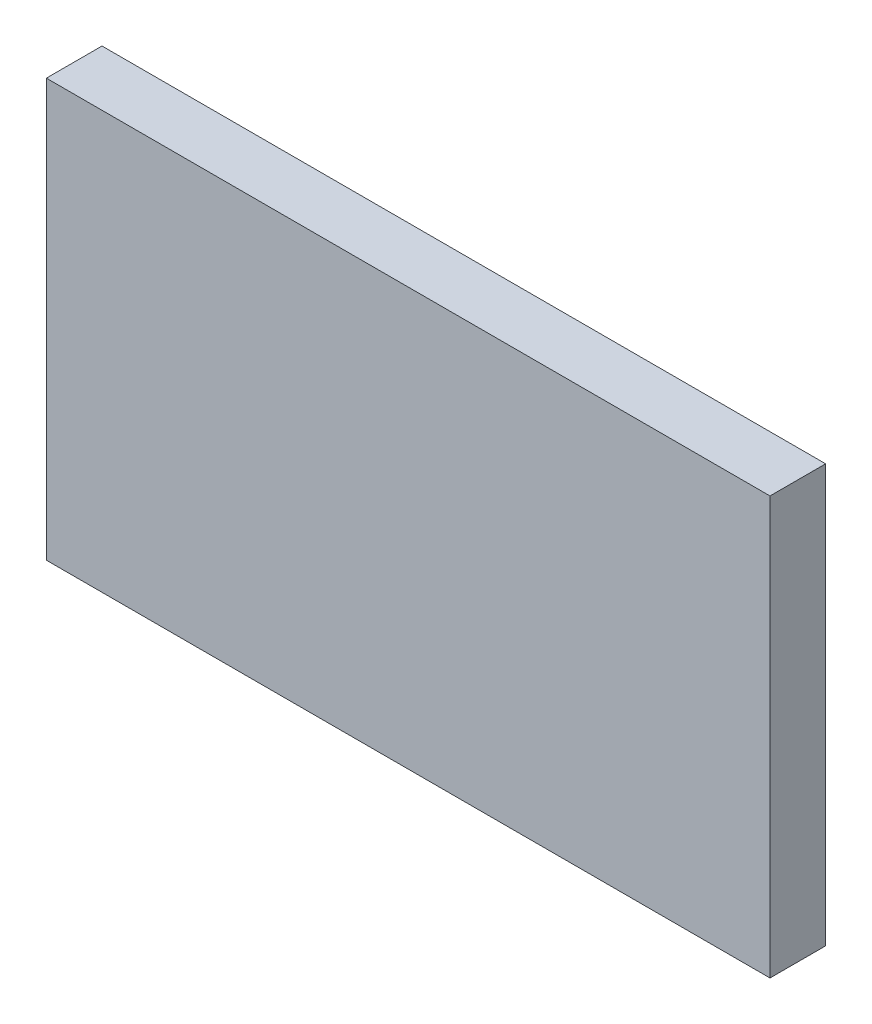
ISO-10303-21;
HEADER;
FILE_DESCRIPTION(('STEP AP214'),'2;1');
FILE_NAME('part.step','',(''),(''),'','','');
FILE_SCHEMA(('AUTOMOTIVE_DESIGN { 1 0 10303 214 1 1 1 1 }'));
ENDSEC;
DATA;
#1=APPLICATION_CONTEXT('core data for automotive mechanical design processes');
#2=APPLICATION_PROTOCOL_DEFINITION('international standard','automotive_design',2000,#1);
#3=PRODUCT_CONTEXT('',#1,'mechanical');
#4=PRODUCT('Part','Part','',(#3));
#5=PRODUCT_RELATED_PRODUCT_CATEGORY('part','',(#4));
#6=PRODUCT_DEFINITION_FORMATION('','',#4);
#7=PRODUCT_DEFINITION_CONTEXT('part definition',#1,'design');
#8=PRODUCT_DEFINITION('design','',#6,#7);
#9=PRODUCT_DEFINITION_SHAPE('','',#8);
#10=(LENGTH_UNIT() NAMED_UNIT(*) SI_UNIT(.MILLI.,.METRE.));
#11=(NAMED_UNIT(*) PLANE_ANGLE_UNIT() SI_UNIT($,.RADIAN.));
#12=(NAMED_UNIT(*) SI_UNIT($,.STERADIAN.) SOLID_ANGLE_UNIT());
#13=UNCERTAINTY_MEASURE_WITH_UNIT(LENGTH_MEASURE(1.E-05),#10,'distance_accuracy_value','');
#14=(GEOMETRIC_REPRESENTATION_CONTEXT(3) GLOBAL_UNCERTAINTY_ASSIGNED_CONTEXT((#13)) GLOBAL_UNIT_ASSIGNED_CONTEXT((#10,
#11,#12)) REPRESENTATION_CONTEXT('',''));
#15=CARTESIAN_POINT('',(0.,0.,0.));
#16=DIRECTION('',(0.,0.,1.));
#17=DIRECTION('',(1.,0.,0.));
#18=AXIS2_PLACEMENT_3D('',#15,#16,#17);
#19=CARTESIAN_POINT('',(0.,75.,0.));
#20=DIRECTION('',(-1.,0.,0.));
#21=DIRECTION('',(0.,0.,1.));
#22=AXIS2_PLACEMENT_3D('',#19,#20,#21);
#23=PLANE('',#22);
#24=DIRECTION('',(0.,0.,-1.));
#25=VECTOR('',#24,1.);
#26=CARTESIAN_POINT('',(0.,0.,0.));
#27=LINE('',#26,#25);
#28=CARTESIAN_POINT('',(0.,0.,0.));
#29=VERTEX_POINT('',#28);
#30=CARTESIAN_POINT('',(0.,0.,-10.));
#31=VERTEX_POINT('',#30);
#32=EDGE_CURVE('E96',#29,#31,#27,.T.);
#33=ORIENTED_EDGE('',*,*,#32,.T.);
#34=DIRECTION('',(0.,-1.,0.));
#35=VECTOR('',#34,1.);
#36=CARTESIAN_POINT('',(0.,75.,-10.));
#37=LINE('',#36,#35);
#38=CARTESIAN_POINT('',(0.,75.,-10.));
#39=VERTEX_POINT('',#38);
#40=EDGE_CURVE('E11',#39,#31,#37,.T.);
#41=ORIENTED_EDGE('',*,*,#40,.F.);
#42=DIRECTION('',(0.,0.,-1.));
#43=VECTOR('',#42,1.);
#44=CARTESIAN_POINT('',(0.,75.,0.));
#45=LINE('',#44,#43);
#46=CARTESIAN_POINT('',(0.,75.,0.));
#47=VERTEX_POINT('',#46);
#48=EDGE_CURVE('E84',#47,#39,#45,.T.);
#49=ORIENTED_EDGE('',*,*,#48,.F.);
#50=DIRECTION('',(0.,-1.,0.));
#51=VECTOR('',#50,1.);
#52=CARTESIAN_POINT('',(0.,75.,0.));
#53=LINE('',#52,#51);
#54=EDGE_CURVE('E92',#47,#29,#53,.T.);
#55=ORIENTED_EDGE('',*,*,#54,.T.);
#56=EDGE_LOOP('',(#33,#41,#49,#55));
#57=FACE_BOUND('',#56,.T.);
#58=ADVANCED_FACE('F33',(#57),#23,.F.);
#59=CARTESIAN_POINT('',(0.,75.,-10.));
#60=DIRECTION('',(0.,0.,1.));
#61=DIRECTION('',(1.,0.,0.));
#62=AXIS2_PLACEMENT_3D('',#59,#60,#61);
#63=PLANE('',#62);
#64=DIRECTION('',(-1.,0.,0.));
#65=VECTOR('',#64,1.);
#66=CARTESIAN_POINT('',(0.,0.,-10.));
#67=LINE('',#66,#65);
#68=CARTESIAN_POINT('',(-130.,0.,-9.99999999999999));
#69=VERTEX_POINT('',#68);
#70=EDGE_CURVE('E88',#31,#69,#67,.T.);
#71=ORIENTED_EDGE('',*,*,#70,.T.);
#72=DIRECTION('',(0.,-1.,0.));
#73=VECTOR('',#72,1.);
#74=CARTESIAN_POINT('',(-130.,75.,-9.99999999999999));
#75=LINE('',#74,#73);
#76=CARTESIAN_POINT('',(-130.,75.,-9.99999999999999));
#77=VERTEX_POINT('',#76);
#78=EDGE_CURVE('E41',#77,#69,#75,.T.);
#79=ORIENTED_EDGE('',*,*,#78,.F.);
#80=DIRECTION('',(-1.,0.,0.));
#81=VECTOR('',#80,1.);
#82=CARTESIAN_POINT('',(0.,75.,-10.));
#83=LINE('',#82,#81);
#84=EDGE_CURVE('E79',#39,#77,#83,.T.);
#85=ORIENTED_EDGE('',*,*,#84,.F.);
#86=ORIENTED_EDGE('',*,*,#40,.T.);
#87=EDGE_LOOP('',(#71,#79,#85,#86));
#88=FACE_BOUND('',#87,.T.);
#89=ADVANCED_FACE('F87',(#88),#63,.F.);
#90=CARTESIAN_POINT('',(-130.,75.,0.));
#91=DIRECTION('',(1.,0.,0.));
#92=DIRECTION('',(0.,0.,-1.));
#93=AXIS2_PLACEMENT_3D('',#90,#91,#92);
#94=PLANE('',#93);
#95=DIRECTION('',(0.,0.,1.));
#96=VECTOR('',#95,1.);
#97=CARTESIAN_POINT('',(-130.,0.,0.));
#98=LINE('',#97,#96);
#99=CARTESIAN_POINT('',(-130.,0.,0.));
#100=VERTEX_POINT('',#99);
#101=EDGE_CURVE('E66',#69,#100,#98,.T.);
#102=ORIENTED_EDGE('',*,*,#101,.T.);
#103=DIRECTION('',(0.,-1.,0.));
#104=VECTOR('',#103,1.);
#105=CARTESIAN_POINT('',(-130.,75.,0.));
#106=LINE('',#105,#104);
#107=CARTESIAN_POINT('',(-130.,75.,0.));
#108=VERTEX_POINT('',#107);
#109=EDGE_CURVE('E89',#108,#100,#106,.T.);
#110=ORIENTED_EDGE('',*,*,#109,.F.);
#111=DIRECTION('',(0.,0.,1.));
#112=VECTOR('',#111,1.);
#113=CARTESIAN_POINT('',(-130.,75.,0.));
#114=LINE('',#113,#112);
#115=EDGE_CURVE('E82',#77,#108,#114,.T.);
#116=ORIENTED_EDGE('',*,*,#115,.F.);
#117=ORIENTED_EDGE('',*,*,#78,.T.);
#118=EDGE_LOOP('',(#102,#110,#116,#117));
#119=FACE_BOUND('',#118,.T.);
#120=ADVANCED_FACE('F90',(#119),#94,.F.);
#121=CARTESIAN_POINT('',(0.,75.,0.));
#122=DIRECTION('',(0.,0.,-1.));
#123=DIRECTION('',(-1.,0.,0.));
#124=AXIS2_PLACEMENT_3D('',#121,#122,#123);
#125=PLANE('',#124);
#126=DIRECTION('',(1.,0.,0.));
#127=VECTOR('',#126,1.);
#128=CARTESIAN_POINT('',(0.,0.,0.));
#129=LINE('',#128,#127);
#130=EDGE_CURVE('E72',#100,#29,#129,.T.);
#131=ORIENTED_EDGE('',*,*,#130,.T.);
#132=ORIENTED_EDGE('',*,*,#54,.F.);
#133=DIRECTION('',(1.,0.,0.));
#134=VECTOR('',#133,1.);
#135=CARTESIAN_POINT('',(0.,75.,0.));
#136=LINE('',#135,#134);
#137=EDGE_CURVE('E49',#108,#47,#136,.T.);
#138=ORIENTED_EDGE('',*,*,#137,.F.);
#139=ORIENTED_EDGE('',*,*,#109,.T.);
#140=EDGE_LOOP('',(#131,#132,#138,#139));
#141=FACE_BOUND('',#140,.T.);
#142=ADVANCED_FACE('F103',(#141),#125,.F.);
#143=CARTESIAN_POINT('',(0.,75.,0.));
#144=DIRECTION('',(0.,1.,0.));
#145=DIRECTION('',(0.,0.,1.));
#146=AXIS2_PLACEMENT_3D('',#143,#144,#145);
#147=PLANE('',#146);
#148=ORIENTED_EDGE('',*,*,#48,.T.);
#149=ORIENTED_EDGE('',*,*,#84,.T.);
#150=ORIENTED_EDGE('',*,*,#115,.T.);
#151=ORIENTED_EDGE('',*,*,#137,.T.);
#152=EDGE_LOOP('',(#148,#149,#150,#151));
#153=FACE_BOUND('',#152,.T.);
#154=ADVANCED_FACE('F80',(#153),#147,.T.);
#155=CARTESIAN_POINT('',(0.,0.,0.));
#156=DIRECTION('',(0.,1.,0.));
#157=DIRECTION('',(0.,0.,1.));
#158=AXIS2_PLACEMENT_3D('',#155,#156,#157);
#159=PLANE('',#158);
#160=ORIENTED_EDGE('',*,*,#32,.F.);
#161=ORIENTED_EDGE('',*,*,#130,.F.);
#162=ORIENTED_EDGE('',*,*,#101,.F.);
#163=ORIENTED_EDGE('',*,*,#70,.F.);
#164=EDGE_LOOP('',(#160,#161,#162,#163));
#165=FACE_BOUND('',#164,.T.);
#166=ADVANCED_FACE('F106',(#165),#159,.F.);
#167=CLOSED_SHELL('',(#58,#89,#120,#142,#154,#166));
#168=MANIFOLD_SOLID_BREP('B2',#167);
#169=ADVANCED_BREP_SHAPE_REPRESENTATION('',(#18,#168),#14);
#170=SHAPE_DEFINITION_REPRESENTATION(#9,#169);
ENDSEC;
END-ISO-10303-21;
